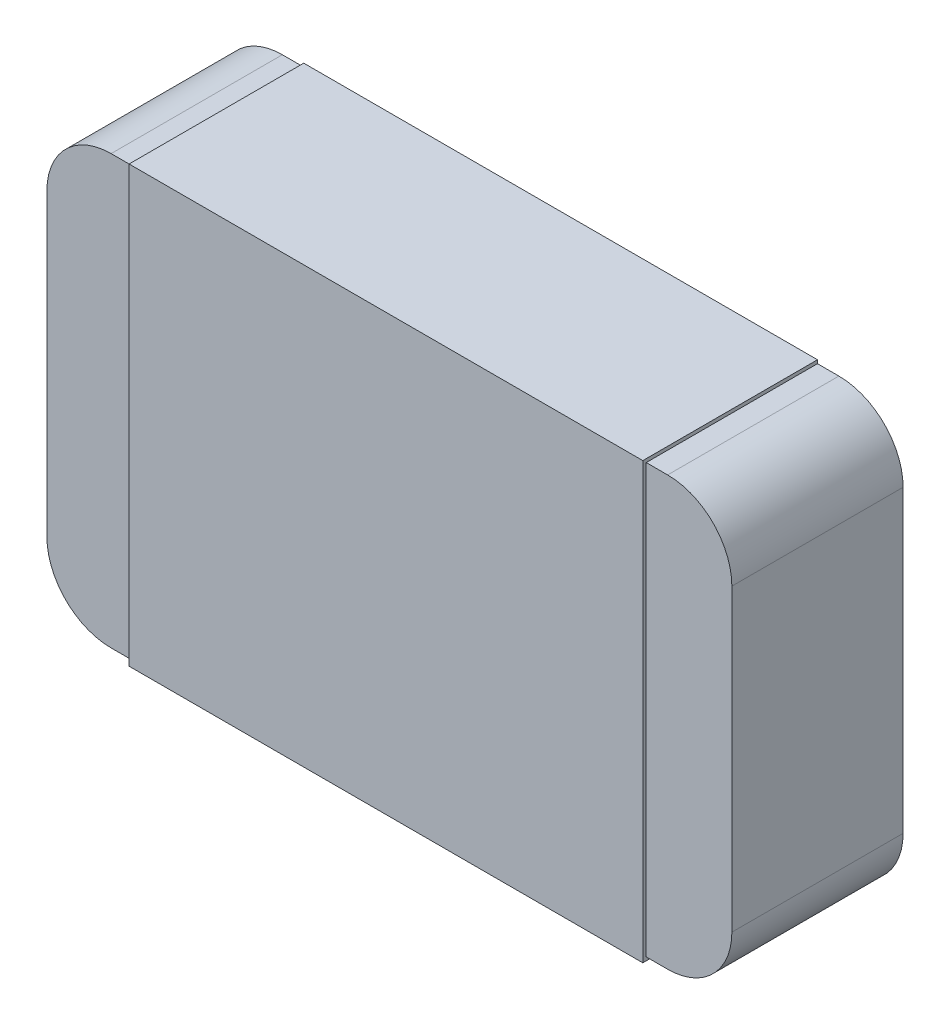
ISO-10303-21;
HEADER;
FILE_DESCRIPTION(('STEP AP214'),'2;1');
FILE_NAME('part.step','',(''),(''),'','','');
FILE_SCHEMA(('AUTOMOTIVE_DESIGN { 1 0 10303 214 1 1 1 1 }'));
ENDSEC;
DATA;
#1=APPLICATION_CONTEXT('core data for automotive mechanical design processes');
#2=APPLICATION_PROTOCOL_DEFINITION('international standard','automotive_design',2000,#1);
#3=PRODUCT_CONTEXT('',#1,'mechanical');
#4=PRODUCT('Part','Part','',(#3));
#5=PRODUCT_RELATED_PRODUCT_CATEGORY('part','',(#4));
#6=PRODUCT_DEFINITION_FORMATION('','',#4);
#7=PRODUCT_DEFINITION_CONTEXT('part definition',#1,'design');
#8=PRODUCT_DEFINITION('design','',#6,#7);
#9=PRODUCT_DEFINITION_SHAPE('','',#8);
#10=(LENGTH_UNIT() NAMED_UNIT(*) SI_UNIT(.MILLI.,.METRE.));
#11=(NAMED_UNIT(*) PLANE_ANGLE_UNIT() SI_UNIT($,.RADIAN.));
#12=(NAMED_UNIT(*) SI_UNIT($,.STERADIAN.) SOLID_ANGLE_UNIT());
#13=UNCERTAINTY_MEASURE_WITH_UNIT(LENGTH_MEASURE(1.E-05),#10,'distance_accuracy_value','');
#14=(GEOMETRIC_REPRESENTATION_CONTEXT(3) GLOBAL_UNCERTAINTY_ASSIGNED_CONTEXT((#13)) GLOBAL_UNIT_ASSIGNED_CONTEXT((#10,
#11,#12)) REPRESENTATION_CONTEXT('',''));
#15=CARTESIAN_POINT('',(0.,0.,0.));
#16=DIRECTION('',(0.,0.,1.));
#17=DIRECTION('',(1.,0.,0.));
#18=AXIS2_PLACEMENT_3D('',#15,#16,#17);
#19=CARTESIAN_POINT('',(-0.999940970499156,0.625046181345618,0.500000027319617));
#20=DIRECTION('',(1.74845553146949E-07,-0.999999999999984,-4.37113882867386E-08));
#21=DIRECTION('',(0.999999999999985,1.74845553146949E-07,0.));
#22=AXIS2_PLACEMENT_3D('',#19,#20,#21);
#23=PLANE('',#22);
#24=DIRECTION('',(-0.999999999999985,-1.74845553146949E-07,0.));
#25=VECTOR('',#24,1.);
#26=CARTESIAN_POINT('',(-0.99994097049916,0.625046203201312,2.73196176792116E-08));
#27=LINE('',#26,#25);
#28=CARTESIAN_POINT('',(-0.749940970499164,0.6250462469127,2.73196176792116E-08));
#29=VERTEX_POINT('',#28);
#30=CARTESIAN_POINT('',(-0.812440970499163,0.625046235984853,2.73196176792116E-08));
#31=VERTEX_POINT('',#30);
#32=EDGE_CURVE('E10',#29,#31,#27,.T.);
#33=ORIENTED_EDGE('',*,*,#32,.T.);
#34=DIRECTION('',(0.,-4.37113882867379E-08,0.999999999999999));
#35=VECTOR('',#34,1.);
#36=CARTESIAN_POINT('',(-0.812440970499159,0.625046214129159,0.500000027319617));
#37=LINE('',#36,#35);
#38=CARTESIAN_POINT('',(-0.812440970499159,0.625046214129159,0.500000027319617));
#39=VERTEX_POINT('',#38);
#40=EDGE_CURVE('E22',#31,#39,#37,.T.);
#41=ORIENTED_EDGE('',*,*,#40,.T.);
#42=DIRECTION('',(-0.999999999999985,-1.74845553146949E-07,0.));
#43=VECTOR('',#42,1.);
#44=CARTESIAN_POINT('',(-0.999940970499156,0.625046181345618,0.500000027319617));
#45=LINE('',#44,#43);
#46=CARTESIAN_POINT('',(-0.74994097049916,0.625046225057006,0.500000027319617));
#47=VERTEX_POINT('',#46);
#48=EDGE_CURVE('E252',#47,#39,#45,.T.);
#49=ORIENTED_EDGE('',*,*,#48,.F.);
#50=DIRECTION('',(0.,4.37113882867379E-08,-0.999999999999999));
#51=VECTOR('',#50,1.);
#52=CARTESIAN_POINT('',(-0.74994097049916,0.625046225057006,0.500000027319617));
#53=LINE('',#52,#51);
#54=EDGE_CURVE('E250',#47,#29,#53,.T.);
#55=ORIENTED_EDGE('',*,*,#54,.T.);
#56=EDGE_LOOP('',(#33,#41,#49,#55));
#57=FACE_BOUND('',#56,.T.);
#58=ADVANCED_FACE('F15',(#57),#23,.F.);
#59=CARTESIAN_POINT('',(-0.999940751942214,-0.624953818654362,0.499999972680382));
#60=DIRECTION('',(-1.74845553146949E-07,0.999999999999984,4.37113882867386E-08));
#61=DIRECTION('',(-0.999999999999985,-1.74845553146949E-07,0.));
#62=AXIS2_PLACEMENT_3D('',#59,#60,#61);
#63=PLANE('',#62);
#64=DIRECTION('',(0.999999999999985,1.74845553146949E-07,0.));
#65=VECTOR('',#64,1.);
#66=CARTESIAN_POINT('',(-0.999940751942214,-0.624953818654362,0.499999972680382));
#67=LINE('',#66,#65);
#68=CARTESIAN_POINT('',(-0.812440751942217,-0.624953785870821,0.499999972680382));
#69=VERTEX_POINT('',#68);
#70=CARTESIAN_POINT('',(-0.749940751942218,-0.624953774942974,0.499999972680382));
#71=VERTEX_POINT('',#70);
#72=EDGE_CURVE('E247',#69,#71,#67,.T.);
#73=ORIENTED_EDGE('',*,*,#72,.F.);
#74=DIRECTION('',(0.,4.37113882867379E-08,-0.999999999999999));
#75=VECTOR('',#74,1.);
#76=CARTESIAN_POINT('',(-0.812440751942217,-0.624953785870821,0.499999972680382));
#77=LINE('',#76,#75);
#78=CARTESIAN_POINT('',(-0.812440751942221,-0.624953764015127,-2.73196176792116E-08));
#79=VERTEX_POINT('',#78);
#80=EDGE_CURVE('E244',#69,#79,#77,.T.);
#81=ORIENTED_EDGE('',*,*,#80,.T.);
#82=DIRECTION('',(0.999999999999985,1.74845553146949E-07,0.));
#83=VECTOR('',#82,1.);
#84=CARTESIAN_POINT('',(-0.999940751942218,-0.624953796798668,-2.73196176792116E-08));
#85=LINE('',#84,#83);
#86=CARTESIAN_POINT('',(-0.749940751942222,-0.62495375308728,-2.73196176792116E-08));
#87=VERTEX_POINT('',#86);
#88=EDGE_CURVE('E242',#79,#87,#85,.T.);
#89=ORIENTED_EDGE('',*,*,#88,.T.);
#90=DIRECTION('',(0.,-4.37113882867379E-08,0.999999999999999));
#91=VECTOR('',#90,1.);
#92=CARTESIAN_POINT('',(-0.749940751942218,-0.624953774942974,0.499999972680382));
#93=LINE('',#92,#91);
#94=EDGE_CURVE('E240',#87,#71,#93,.T.);
#95=ORIENTED_EDGE('',*,*,#94,.T.);
#96=EDGE_LOOP('',(#73,#81,#89,#95));
#97=FACE_BOUND('',#96,.T.);
#98=ADVANCED_FACE('F308',(#97),#63,.F.);
#99=CARTESIAN_POINT('',(5.91387792996856E-05,4.63561911807631E-05,0.5));
#100=DIRECTION('',(0.,-4.37113882867379E-08,0.999999999999999));
#101=DIRECTION('',(1.74845553146949E-07,-0.999999999999984,-4.37113882867386E-08));
#102=AXIS2_PLACEMENT_3D('',#99,#100,#101);
#103=PLANE('',#102);
#104=ORIENTED_EDGE('',*,*,#48,.T.);
#105=CARTESIAN_POINT('',(-0.812440937715618,0.437546214129162,0.500000019123732));
#106=DIRECTION('',(0.,-4.37113882867379E-08,0.999999999999999));
#107=DIRECTION('',(1.74845553146949E-07,-0.999999999999984,-4.37113882867386E-08));
#108=AXIS2_PLACEMENT_3D('',#105,#106,#107);
#109=CIRCLE('',#108,0.1875);
#110=CARTESIAN_POINT('',(-0.999940937715615,0.437546181345621,0.500000019123732));
#111=VERTEX_POINT('',#110);
#112=EDGE_CURVE('E237',#39,#111,#109,.T.);
#113=ORIENTED_EDGE('',*,*,#112,.T.);
#114=DIRECTION('',(1.74845553320421E-07,-0.999999999999984,-4.37113882867386E-08));
#115=VECTOR('',#114,1.);
#116=CARTESIAN_POINT('',(-0.999940970499156,0.625046181345618,0.500000027319617));
#117=LINE('',#116,#115);
#118=CARTESIAN_POINT('',(-0.999940784725755,-0.437453818654365,0.499999980876267));
#119=VERTEX_POINT('',#118);
#120=EDGE_CURVE('E235',#111,#119,#117,.T.);
#121=ORIENTED_EDGE('',*,*,#120,.T.);
#122=CARTESIAN_POINT('',(-0.812440784725759,-0.437453785870824,0.499999980876267));
#123=DIRECTION('',(0.,-4.37113882867379E-08,0.999999999999999));
#124=DIRECTION('',(1.74845553146949E-07,-0.999999999999984,-4.37113882867386E-08));
#125=AXIS2_PLACEMENT_3D('',#122,#123,#124);
#126=CIRCLE('',#125,0.1875);
#127=EDGE_CURVE('E233',#119,#69,#126,.T.);
#128=ORIENTED_EDGE('',*,*,#127,.T.);
#129=ORIENTED_EDGE('',*,*,#72,.T.);
#130=DIRECTION('',(1.74845553146949E-07,-0.999999999999984,-4.37113882867386E-08));
#131=VECTOR('',#130,1.);
#132=CARTESIAN_POINT('',(-0.74994097049916,0.625046225057006,0.500000027319617));
#133=LINE('',#132,#131);
#134=EDGE_CURVE('E230',#47,#71,#133,.T.);
#135=ORIENTED_EDGE('',*,*,#134,.F.);
#136=EDGE_LOOP('',(#104,#113,#121,#128,#129,#135));
#137=FACE_BOUND('',#136,.T.);
#138=ADVANCED_FACE('F262',(#137),#103,.T.);
#139=CARTESIAN_POINT('',(1.00005902950081,0.625046531036724,0.500000027319617));
#140=DIRECTION('',(-0.999999999999985,-1.74845553146949E-07,0.));
#141=DIRECTION('',(1.74845553146949E-07,-0.999999999999984,-4.37113882867386E-08));
#142=AXIS2_PLACEMENT_3D('',#139,#140,#141);
#143=PLANE('',#142);
#144=DIRECTION('',(-1.74845553146949E-07,0.999999999999984,4.37113882867386E-08));
#145=VECTOR('',#144,1.);
#146=CARTESIAN_POINT('',(1.00005902950081,0.625046552892418,2.73196176792116E-08));
#147=LINE('',#146,#145);
#148=CARTESIAN_POINT('',(1.00005921527421,-0.437453447107565,-1.91237323754481E-08));
#149=VERTEX_POINT('',#148);
#150=CARTESIAN_POINT('',(1.00005906228435,0.437546552892421,1.91237323754481E-08));
#151=VERTEX_POINT('',#150);
#152=EDGE_CURVE('E228',#149,#151,#147,.T.);
#153=ORIENTED_EDGE('',*,*,#152,.T.);
#154=DIRECTION('',(0.,-4.37113882867379E-08,0.999999999999999));
#155=VECTOR('',#154,1.);
#156=CARTESIAN_POINT('',(1.00005906228436,0.437546531036727,0.500000019123732));
#157=LINE('',#156,#155);
#158=CARTESIAN_POINT('',(1.00005906228436,0.437546531036727,0.500000019123732));
#159=VERTEX_POINT('',#158);
#160=EDGE_CURVE('E226',#151,#159,#157,.T.);
#161=ORIENTED_EDGE('',*,*,#160,.T.);
#162=DIRECTION('',(-1.74845553146949E-07,0.999999999999984,4.37113882867386E-08));
#163=VECTOR('',#162,1.);
#164=CARTESIAN_POINT('',(1.00005902950081,0.625046531036724,0.500000027319617));
#165=LINE('',#164,#163);
#166=CARTESIAN_POINT('',(1.00005921527421,-0.437453468963259,0.499999980876267));
#167=VERTEX_POINT('',#166);
#168=EDGE_CURVE('E223',#167,#159,#165,.T.);
#169=ORIENTED_EDGE('',*,*,#168,.F.);
#170=DIRECTION('',(0.,4.37113882867379E-08,-0.999999999999999));
#171=VECTOR('',#170,1.);
#172=CARTESIAN_POINT('',(1.00005921527421,-0.437453468963259,0.499999980876267));
#173=LINE('',#172,#171);
#174=EDGE_CURVE('E220',#167,#149,#173,.T.);
#175=ORIENTED_EDGE('',*,*,#174,.T.);
#176=EDGE_LOOP('',(#153,#161,#169,#175));
#177=FACE_BOUND('',#176,.T.);
#178=ADVANCED_FACE('F291',(#177),#143,.F.);
#179=CARTESIAN_POINT('',(-0.999940970499156,0.625046181345618,0.500000027319617));
#180=DIRECTION('',(1.74845553146949E-07,-0.999999999999984,-4.37113882867386E-08));
#181=DIRECTION('',(0.999999999999985,1.74845553146949E-07,0.));
#182=AXIS2_PLACEMENT_3D('',#179,#180,#181);
#183=PLANE('',#182);
#184=DIRECTION('',(-0.999999999999985,-1.74845553146949E-07,0.));
#185=VECTOR('',#184,1.);
#186=CARTESIAN_POINT('',(-0.999940970499156,0.625046181345618,0.500000027319617));
#187=LINE('',#186,#185);
#188=CARTESIAN_POINT('',(0.812559029500817,0.625046498253183,0.500000027319617));
#189=VERTEX_POINT('',#188);
#190=CARTESIAN_POINT('',(0.750059029500818,0.625046487325336,0.500000027319617));
#191=VERTEX_POINT('',#190);
#192=EDGE_CURVE('E217',#189,#191,#187,.T.);
#193=ORIENTED_EDGE('',*,*,#192,.F.);
#194=DIRECTION('',(0.,4.37113882867379E-08,-0.999999999999999));
#195=VECTOR('',#194,1.);
#196=CARTESIAN_POINT('',(0.812559029500817,0.625046498253183,0.500000027319617));
#197=LINE('',#196,#195);
#198=CARTESIAN_POINT('',(0.812559029500813,0.625046520108877,2.73196176792116E-08));
#199=VERTEX_POINT('',#198);
#200=EDGE_CURVE('E214',#189,#199,#197,.T.);
#201=ORIENTED_EDGE('',*,*,#200,.T.);
#202=DIRECTION('',(-0.999999999999985,-1.74845553146949E-07,0.));
#203=VECTOR('',#202,1.);
#204=CARTESIAN_POINT('',(-0.99994097049916,0.625046203201312,2.73196176792116E-08));
#205=LINE('',#204,#203);
#206=CARTESIAN_POINT('',(0.750059029500814,0.62504650918103,2.73196176792116E-08));
#207=VERTEX_POINT('',#206);
#208=EDGE_CURVE('E212',#199,#207,#205,.T.);
#209=ORIENTED_EDGE('',*,*,#208,.T.);
#210=DIRECTION('',(0.,-4.37113882867379E-08,0.999999999999999));
#211=VECTOR('',#210,1.);
#212=CARTESIAN_POINT('',(0.750059029500818,0.625046487325336,0.500000027319617));
#213=LINE('',#212,#211);
#214=EDGE_CURVE('E210',#207,#191,#213,.T.);
#215=ORIENTED_EDGE('',*,*,#214,.T.);
#216=EDGE_LOOP('',(#193,#201,#209,#215));
#217=FACE_BOUND('',#216,.T.);
#218=ADVANCED_FACE('F285',(#217),#183,.F.);
#219=CARTESIAN_POINT('',(-0.999940970499156,0.625046181345618,0.500000027319617));
#220=DIRECTION('',(0.999999999999985,1.74845553320421E-07,0.));
#221=DIRECTION('',(-1.74845553320421E-07,0.999999999999984,4.37113882867386E-08));
#222=AXIS2_PLACEMENT_3D('',#219,#220,#221);
#223=PLANE('',#222);
#224=ORIENTED_EDGE('',*,*,#120,.F.);
#225=DIRECTION('',(0.,4.37113882867379E-08,-0.999999999999999));
#226=VECTOR('',#225,1.);
#227=CARTESIAN_POINT('',(-0.999940937715615,0.437546181345621,0.500000019123732));
#228=LINE('',#227,#226);
#229=CARTESIAN_POINT('',(-0.999940937715618,0.437546203201315,1.91237323754481E-08));
#230=VERTEX_POINT('',#229);
#231=EDGE_CURVE('E207',#111,#230,#228,.T.);
#232=ORIENTED_EDGE('',*,*,#231,.T.);
#233=DIRECTION('',(1.74845553320421E-07,-0.999999999999984,-4.37113882867386E-08));
#234=VECTOR('',#233,1.);
#235=CARTESIAN_POINT('',(-0.99994097049916,0.625046203201312,2.73196176792116E-08));
#236=LINE('',#235,#234);
#237=CARTESIAN_POINT('',(-0.999940784725759,-0.437453796798671,-1.91237323754481E-08));
#238=VERTEX_POINT('',#237);
#239=EDGE_CURVE('E205',#230,#238,#236,.T.);
#240=ORIENTED_EDGE('',*,*,#239,.T.);
#241=DIRECTION('',(0.,-4.37113882867379E-08,0.999999999999999));
#242=VECTOR('',#241,1.);
#243=CARTESIAN_POINT('',(-0.999940784725755,-0.437453818654365,0.499999980876267));
#244=LINE('',#243,#242);
#245=EDGE_CURVE('E202',#238,#119,#244,.T.);
#246=ORIENTED_EDGE('',*,*,#245,.T.);
#247=EDGE_LOOP('',(#224,#232,#240,#246));
#248=FACE_BOUND('',#247,.T.);
#249=ADVANCED_FACE('F297',(#248),#223,.F.);
#250=CARTESIAN_POINT('',(-0.999940751942214,-0.624953818654362,0.499999972680382));
#251=DIRECTION('',(-1.74845553146949E-07,0.999999999999984,4.37113882867386E-08));
#252=DIRECTION('',(-0.999999999999985,-1.74845553146949E-07,0.));
#253=AXIS2_PLACEMENT_3D('',#250,#251,#252);
#254=PLANE('',#253);
#255=DIRECTION('',(0.999999999999985,1.74845553146949E-07,0.));
#256=VECTOR('',#255,1.);
#257=CARTESIAN_POINT('',(-0.999940751942218,-0.624953796798668,-2.73196176792116E-08));
#258=LINE('',#257,#256);
#259=CARTESIAN_POINT('',(0.750059248057755,-0.62495349081895,-2.73196176792116E-08));
#260=VERTEX_POINT('',#259);
#261=CARTESIAN_POINT('',(0.812559248057754,-0.624953479891103,-2.73196176792116E-08));
#262=VERTEX_POINT('',#261);
#263=EDGE_CURVE('E199',#260,#262,#258,.T.);
#264=ORIENTED_EDGE('',*,*,#263,.T.);
#265=DIRECTION('',(0.,-4.37113882867379E-08,0.999999999999999));
#266=VECTOR('',#265,1.);
#267=CARTESIAN_POINT('',(0.812559248057758,-0.624953501746797,0.499999972680382));
#268=LINE('',#267,#266);
#269=CARTESIAN_POINT('',(0.812559248057758,-0.624953501746797,0.499999972680382));
#270=VERTEX_POINT('',#269);
#271=EDGE_CURVE('E197',#262,#270,#268,.T.);
#272=ORIENTED_EDGE('',*,*,#271,.T.);
#273=DIRECTION('',(0.999999999999985,1.74845553146949E-07,0.));
#274=VECTOR('',#273,1.);
#275=CARTESIAN_POINT('',(-0.999940751942214,-0.624953818654362,0.499999972680382));
#276=LINE('',#275,#274);
#277=CARTESIAN_POINT('',(0.750059248057759,-0.624953512674644,0.499999972680382));
#278=VERTEX_POINT('',#277);
#279=EDGE_CURVE('E194',#278,#270,#276,.T.);
#280=ORIENTED_EDGE('',*,*,#279,.F.);
#281=DIRECTION('',(0.,4.37113882867379E-08,-0.999999999999999));
#282=VECTOR('',#281,1.);
#283=CARTESIAN_POINT('',(0.750059248057759,-0.624953512674644,0.499999972680382));
#284=LINE('',#283,#282);
#285=EDGE_CURVE('E192',#278,#260,#284,.T.);
#286=ORIENTED_EDGE('',*,*,#285,.T.);
#287=EDGE_LOOP('',(#264,#272,#280,#286));
#288=FACE_BOUND('',#287,.T.);
#289=ADVANCED_FACE('F295',(#288),#254,.F.);
#290=CARTESIAN_POINT('',(5.91387792996856E-05,4.63561911807631E-05,0.5));
#291=DIRECTION('',(0.,-4.37113882867379E-08,0.999999999999999));
#292=DIRECTION('',(1.74845553146949E-07,-0.999999999999984,-4.37113882867386E-08));
#293=AXIS2_PLACEMENT_3D('',#290,#291,#292);
#294=PLANE('',#293);
#295=ORIENTED_EDGE('',*,*,#168,.T.);
#296=CARTESIAN_POINT('',(0.812559062284358,0.437546498253186,0.500000019123732));
#297=DIRECTION('',(0.,-4.37113882867379E-08,0.999999999999999));
#298=DIRECTION('',(1.74845553146949E-07,-0.999999999999984,-4.37113882867386E-08));
#299=AXIS2_PLACEMENT_3D('',#296,#297,#298);
#300=CIRCLE('',#299,0.1875);
#301=EDGE_CURVE('E189',#159,#189,#300,.T.);
#302=ORIENTED_EDGE('',*,*,#301,.T.);
#303=ORIENTED_EDGE('',*,*,#192,.T.);
#304=DIRECTION('',(-1.74845553146949E-07,0.999999999999984,4.37113882867386E-08));
#305=VECTOR('',#304,1.);
#306=CARTESIAN_POINT('',(0.750059029500818,0.625046487325336,0.500000027319617));
#307=LINE('',#306,#305);
#308=EDGE_CURVE('E187',#278,#191,#307,.T.);
#309=ORIENTED_EDGE('',*,*,#308,.F.);
#310=ORIENTED_EDGE('',*,*,#279,.T.);
#311=CARTESIAN_POINT('',(0.812559215274217,-0.4374535017468,0.499999980876267));
#312=DIRECTION('',(0.,-4.37113882867379E-08,0.999999999999999));
#313=DIRECTION('',(1.74845553146949E-07,-0.999999999999984,-4.37113882867386E-08));
#314=AXIS2_PLACEMENT_3D('',#311,#312,#313);
#315=CIRCLE('',#314,0.1875);
#316=EDGE_CURVE('E184',#270,#167,#315,.T.);
#317=ORIENTED_EDGE('',*,*,#316,.T.);
#318=EDGE_LOOP('',(#295,#302,#303,#309,#310,#317));
#319=FACE_BOUND('',#318,.T.);
#320=ADVANCED_FACE('F280',(#319),#294,.T.);
#321=CARTESIAN_POINT('',(5.91387792958642E-05,4.63780468749064E-05,0.));
#322=DIRECTION('',(0.,-4.37113882867379E-08,0.999999999999999));
#323=DIRECTION('',(1.74845553146949E-07,-0.999999999999984,-4.37113882867386E-08));
#324=AXIS2_PLACEMENT_3D('',#321,#322,#323);
#325=PLANE('',#324);
#326=ORIENTED_EDGE('',*,*,#208,.F.);
#327=CARTESIAN_POINT('',(0.812559062284354,0.43754652010888,1.91237323754481E-08));
#328=DIRECTION('',(0.,4.37113882867379E-08,-0.999999999999999));
#329=DIRECTION('',(1.74845553146949E-07,-0.999999999999984,-4.37113882867386E-08));
#330=AXIS2_PLACEMENT_3D('',#327,#328,#329);
#331=CIRCLE('',#330,0.1875);
#332=EDGE_CURVE('E181',#199,#151,#331,.T.);
#333=ORIENTED_EDGE('',*,*,#332,.T.);
#334=ORIENTED_EDGE('',*,*,#152,.F.);
#335=CARTESIAN_POINT('',(0.812559215274213,-0.437453479891106,-1.91237323754481E-08));
#336=DIRECTION('',(0.,4.37113882867379E-08,-0.999999999999999));
#337=DIRECTION('',(1.74845553146949E-07,-0.999999999999984,-4.37113882867386E-08));
#338=AXIS2_PLACEMENT_3D('',#335,#336,#337);
#339=CIRCLE('',#338,0.1875);
#340=EDGE_CURVE('E178',#149,#262,#339,.T.);
#341=ORIENTED_EDGE('',*,*,#340,.T.);
#342=ORIENTED_EDGE('',*,*,#263,.F.);
#343=DIRECTION('',(1.74845553146949E-07,-0.999999999999984,-4.37113882867386E-08));
#344=VECTOR('',#343,1.);
#345=CARTESIAN_POINT('',(0.750059027752358,0.635046509181029,2.7756731562079E-08));
#346=LINE('',#345,#344);
#347=CARTESIAN_POINT('',(0.750059249806211,-0.63495349081895,-2.7756731562079E-08));
#348=VERTEX_POINT('',#347);
#349=EDGE_CURVE('E176',#260,#348,#346,.T.);
#350=ORIENTED_EDGE('',*,*,#349,.T.);
#351=DIRECTION('',(0.999999999999985,1.74845553146949E-07,0.));
#352=VECTOR('',#351,1.);
#353=CARTESIAN_POINT('',(-0.749940750193766,-0.63495375308728,-2.7756731562079E-08));
#354=LINE('',#353,#352);
#355=CARTESIAN_POINT('',(-0.749940750193766,-0.63495375308728,-2.7756731562079E-08));
#356=VERTEX_POINT('',#355);
#357=EDGE_CURVE('E143',#356,#348,#354,.T.);
#358=ORIENTED_EDGE('',*,*,#357,.F.);
#359=DIRECTION('',(1.74845553146949E-07,-0.999999999999984,-4.37113882867386E-08));
#360=VECTOR('',#359,1.);
#361=CARTESIAN_POINT('',(-0.749940972247619,0.6350462469127,2.7756731562079E-08));
#362=LINE('',#361,#360);
#363=EDGE_CURVE('E172',#87,#356,#362,.T.);
#364=ORIENTED_EDGE('',*,*,#363,.F.);
#365=ORIENTED_EDGE('',*,*,#88,.F.);
#366=CARTESIAN_POINT('',(-0.812440784725762,-0.43745376401513,-1.91237323754481E-08));
#367=DIRECTION('',(0.,4.37113882867379E-08,-0.999999999999999));
#368=DIRECTION('',(1.74845553146949E-07,-0.999999999999984,-4.37113882867386E-08));
#369=AXIS2_PLACEMENT_3D('',#366,#367,#368);
#370=CIRCLE('',#369,0.1875);
#371=EDGE_CURVE('E169',#79,#238,#370,.T.);
#372=ORIENTED_EDGE('',*,*,#371,.T.);
#373=ORIENTED_EDGE('',*,*,#239,.F.);
#374=CARTESIAN_POINT('',(-0.812440937715622,0.437546235984856,1.91237323754481E-08));
#375=DIRECTION('',(0.,4.37113882867379E-08,-0.999999999999999));
#376=DIRECTION('',(1.74845554303431E-07,-0.999999999999984,-4.37113882867386E-08));
#377=AXIS2_PLACEMENT_3D('',#374,#375,#376);
#378=CIRCLE('',#377,0.1875);
#379=EDGE_CURVE('E167',#230,#31,#378,.T.);
#380=ORIENTED_EDGE('',*,*,#379,.T.);
#381=ORIENTED_EDGE('',*,*,#32,.F.);
#382=DIRECTION('',(1.74845553146949E-07,-0.999999999999984,-4.37113882867386E-08));
#383=VECTOR('',#382,1.);
#384=CARTESIAN_POINT('',(-0.749940972247619,0.6350462469127,2.7756731562079E-08));
#385=LINE('',#384,#383);
#386=CARTESIAN_POINT('',(-0.749940972247619,0.6350462469127,2.7756731562079E-08));
#387=VERTEX_POINT('',#386);
#388=EDGE_CURVE('E165',#387,#29,#385,.T.);
#389=ORIENTED_EDGE('',*,*,#388,.F.);
#390=DIRECTION('',(0.999999999999985,1.74845553146949E-07,0.));
#391=VECTOR('',#390,1.);
#392=CARTESIAN_POINT('',(-0.749940972247619,0.6350462469127,2.7756731562079E-08));
#393=LINE('',#392,#391);
#394=CARTESIAN_POINT('',(0.750059027752358,0.635046509181029,2.7756731562079E-08));
#395=VERTEX_POINT('',#394);
#396=EDGE_CURVE('E162',#387,#395,#393,.T.);
#397=ORIENTED_EDGE('',*,*,#396,.T.);
#398=DIRECTION('',(1.74845553146949E-07,-0.999999999999984,-4.37113882867386E-08));
#399=VECTOR('',#398,1.);
#400=CARTESIAN_POINT('',(0.750059027752358,0.635046509181029,2.7756731562079E-08));
#401=LINE('',#400,#399);
#402=EDGE_CURVE('E159',#395,#207,#401,.T.);
#403=ORIENTED_EDGE('',*,*,#402,.T.);
#404=EDGE_LOOP('',(#326,#333,#334,#341,#342,#350,#358,#364,#365,#372,#373,#380,#381,#389,#397,#403));
#405=FACE_BOUND('',#404,.T.);
#406=ADVANCED_FACE('F270',(#405),#325,.F.);
#407=CARTESIAN_POINT('',(-0.74994097049916,0.625046224619892,0.510000027319617));
#408=DIRECTION('',(0.999999999999985,1.74845553146949E-07,0.));
#409=DIRECTION('',(-1.74845553146949E-07,0.999999999999984,4.37113882867386E-08));
#410=AXIS2_PLACEMENT_3D('',#407,#408,#409);
#411=PLANE('',#410);
#412=ORIENTED_EDGE('',*,*,#134,.T.);
#413=ORIENTED_EDGE('',*,*,#94,.F.);
#414=ORIENTED_EDGE('',*,*,#363,.T.);
#415=DIRECTION('',(0.,4.37113882867379E-08,-0.999999999999999));
#416=VECTOR('',#415,1.);
#417=CARTESIAN_POINT('',(-0.749940750193763,-0.634953775380088,0.509999972243268));
#418=LINE('',#417,#416);
#419=CARTESIAN_POINT('',(-0.749940750193763,-0.634953775380088,0.509999972243268));
#420=VERTEX_POINT('',#419);
#421=EDGE_CURVE('E157',#420,#356,#418,.T.);
#422=ORIENTED_EDGE('',*,*,#421,.F.);
#423=DIRECTION('',(1.74845553146949E-07,-0.999999999999984,-4.37113882867386E-08));
#424=VECTOR('',#423,1.);
#425=CARTESIAN_POINT('',(-0.74994097049916,0.625046224619892,0.510000027319617));
#426=LINE('',#425,#424);
#427=CARTESIAN_POINT('',(-0.749940972247615,0.635046224619892,0.510000027756731));
#428=VERTEX_POINT('',#427);
#429=EDGE_CURVE('E148',#428,#420,#426,.T.);
#430=ORIENTED_EDGE('',*,*,#429,.F.);
#431=DIRECTION('',(0.,4.37113882867379E-08,-0.999999999999999));
#432=VECTOR('',#431,1.);
#433=CARTESIAN_POINT('',(-0.749940972247615,0.635046224619892,0.510000027756731));
#434=LINE('',#433,#432);
#435=EDGE_CURVE('E154',#428,#387,#434,.T.);
#436=ORIENTED_EDGE('',*,*,#435,.T.);
#437=ORIENTED_EDGE('',*,*,#388,.T.);
#438=ORIENTED_EDGE('',*,*,#54,.F.);
#439=EDGE_LOOP('',(#412,#413,#414,#422,#430,#436,#437,#438));
#440=FACE_BOUND('',#439,.T.);
#441=ADVANCED_FACE('F266',(#440),#411,.F.);
#442=CARTESIAN_POINT('',(0.750059029500818,0.625046486888222,0.510000027319617));
#443=DIRECTION('',(-0.999999999999985,-1.74845553146949E-07,0.));
#444=DIRECTION('',(1.74845553146949E-07,-0.999999999999984,-4.37113882867386E-08));
#445=AXIS2_PLACEMENT_3D('',#442,#443,#444);
#446=PLANE('',#445);
#447=ORIENTED_EDGE('',*,*,#308,.T.);
#448=ORIENTED_EDGE('',*,*,#214,.F.);
#449=ORIENTED_EDGE('',*,*,#402,.F.);
#450=DIRECTION('',(0.,-4.37113882867379E-08,0.999999999999999));
#451=VECTOR('',#450,1.);
#452=CARTESIAN_POINT('',(0.750059027752362,0.635046486888222,0.510000027756731));
#453=LINE('',#452,#451);
#454=CARTESIAN_POINT('',(0.750059027752362,0.635046486888222,0.510000027756731));
#455=VERTEX_POINT('',#454);
#456=EDGE_CURVE('E131',#395,#455,#453,.T.);
#457=ORIENTED_EDGE('',*,*,#456,.T.);
#458=DIRECTION('',(-1.74845553146949E-07,0.999999999999984,4.37113882867386E-08));
#459=VECTOR('',#458,1.);
#460=CARTESIAN_POINT('',(0.750059029500818,0.625046486888222,0.510000027319617));
#461=LINE('',#460,#459);
#462=CARTESIAN_POINT('',(0.750059249806215,-0.634953513111758,0.509999972243268));
#463=VERTEX_POINT('',#462);
#464=EDGE_CURVE('E123',#463,#455,#461,.T.);
#465=ORIENTED_EDGE('',*,*,#464,.F.);
#466=DIRECTION('',(0.,-4.37113882867379E-08,0.999999999999999));
#467=VECTOR('',#466,1.);
#468=CARTESIAN_POINT('',(0.750059249806215,-0.634953513111758,0.509999972243268));
#469=LINE('',#468,#467);
#470=EDGE_CURVE('E128',#348,#463,#469,.T.);
#471=ORIENTED_EDGE('',*,*,#470,.F.);
#472=ORIENTED_EDGE('',*,*,#349,.F.);
#473=ORIENTED_EDGE('',*,*,#285,.F.);
#474=EDGE_LOOP('',(#447,#448,#449,#457,#465,#471,#472,#473));
#475=FACE_BOUND('',#474,.T.);
#476=ADVANCED_FACE('F126',(#475),#446,.F.);
#477=CARTESIAN_POINT('',(5.9138779299762E-05,4.63557540668802E-05,0.51));
#478=DIRECTION('',(0.,-4.37113882867379E-08,0.999999999999999));
#479=DIRECTION('',(1.74845553146949E-07,-0.999999999999984,-4.37113882867386E-08));
#480=AXIS2_PLACEMENT_3D('',#477,#478,#479);
#481=PLANE('',#480);
#482=ORIENTED_EDGE('',*,*,#429,.T.);
#483=DIRECTION('',(-0.999999999999985,-1.74845553146949E-07,0.));
#484=VECTOR('',#483,1.);
#485=CARTESIAN_POINT('',(-0.749940750193763,-0.634953775380088,0.509999972243268));
#486=LINE('',#485,#484);
#487=EDGE_CURVE('E141',#463,#420,#486,.T.);
#488=ORIENTED_EDGE('',*,*,#487,.F.);
#489=ORIENTED_EDGE('',*,*,#464,.T.);
#490=DIRECTION('',(-0.999999999999985,-1.74845553146949E-07,0.));
#491=VECTOR('',#490,1.);
#492=CARTESIAN_POINT('',(-0.749940972247615,0.635046224619892,0.510000027756731));
#493=LINE('',#492,#491);
#494=EDGE_CURVE('E149',#455,#428,#493,.T.);
#495=ORIENTED_EDGE('',*,*,#494,.T.);
#496=EDGE_LOOP('',(#482,#488,#489,#495));
#497=FACE_BOUND('',#496,.T.);
#498=ADVANCED_FACE('F146',(#497),#481,.T.);
#499=CARTESIAN_POINT('',(5.92498062221125E-05,-0.634953621953115,-2.7756731562079E-08));
#500=DIRECTION('',(1.74845553146949E-07,-0.999999999999984,-4.37113882867386E-08));
#501=DIRECTION('',(0.999999999999985,1.74845553146949E-07,0.));
#502=AXIS2_PLACEMENT_3D('',#499,#500,#501);
#503=PLANE('',#502);
#504=ORIENTED_EDGE('',*,*,#421,.T.);
#505=ORIENTED_EDGE('',*,*,#357,.T.);
#506=ORIENTED_EDGE('',*,*,#470,.T.);
#507=ORIENTED_EDGE('',*,*,#487,.T.);
#508=EDGE_LOOP('',(#504,#505,#506,#507));
#509=FACE_BOUND('',#508,.T.);
#510=ADVANCED_FACE('F140',(#509),#503,.T.);
#511=CARTESIAN_POINT('',(5.90277523696159E-05,0.635046378046865,2.7756731562079E-08));
#512=DIRECTION('',(1.74845553146949E-07,-0.999999999999984,-4.37113882867386E-08));
#513=DIRECTION('',(0.999999999999985,1.74845553146949E-07,0.));
#514=AXIS2_PLACEMENT_3D('',#511,#512,#513);
#515=PLANE('',#514);
#516=ORIENTED_EDGE('',*,*,#435,.F.);
#517=ORIENTED_EDGE('',*,*,#494,.F.);
#518=ORIENTED_EDGE('',*,*,#456,.F.);
#519=ORIENTED_EDGE('',*,*,#396,.F.);
#520=EDGE_LOOP('',(#516,#517,#518,#519));
#521=FACE_BOUND('',#520,.T.);
#522=ADVANCED_FACE('F272',(#521),#515,.F.);
#523=CARTESIAN_POINT('',(0.812559062284358,0.437546498253186,0.500000019123732));
#524=DIRECTION('',(0.,4.37113882867379E-08,-0.999999999999999));
#525=DIRECTION('',(-1.74845553146949E-07,0.999999999999984,4.37113882867386E-08));
#526=AXIS2_PLACEMENT_3D('',#523,#524,#525);
#527=CYLINDRICAL_SURFACE('',#526,0.1875);
#528=ORIENTED_EDGE('',*,*,#301,.F.);
#529=ORIENTED_EDGE('',*,*,#160,.F.);
#530=ORIENTED_EDGE('',*,*,#332,.F.);
#531=ORIENTED_EDGE('',*,*,#200,.F.);
#532=EDGE_LOOP('',(#528,#529,#530,#531));
#533=FACE_BOUND('',#532,.T.);
#534=ADVANCED_FACE('F288',(#533),#527,.T.);
#535=CARTESIAN_POINT('',(0.812559215274217,-0.4374535017468,0.499999980876267));
#536=DIRECTION('',(0.,4.37113882867379E-08,-0.999999999999999));
#537=DIRECTION('',(-1.74845553146949E-07,0.999999999999984,4.37113882867386E-08));
#538=AXIS2_PLACEMENT_3D('',#535,#536,#537);
#539=CYLINDRICAL_SURFACE('',#538,0.1875);
#540=ORIENTED_EDGE('',*,*,#316,.F.);
#541=ORIENTED_EDGE('',*,*,#271,.F.);
#542=ORIENTED_EDGE('',*,*,#340,.F.);
#543=ORIENTED_EDGE('',*,*,#174,.F.);
#544=EDGE_LOOP('',(#540,#541,#542,#543));
#545=FACE_BOUND('',#544,.T.);
#546=ADVANCED_FACE('F293',(#545),#539,.T.);
#547=CARTESIAN_POINT('',(-0.812440937715618,0.437546214129162,0.500000019123732));
#548=DIRECTION('',(0.,4.37113882867379E-08,-0.999999999999999));
#549=DIRECTION('',(-1.74845553146949E-07,0.999999999999984,4.37113882867386E-08));
#550=AXIS2_PLACEMENT_3D('',#547,#548,#549);
#551=CYLINDRICAL_SURFACE('',#550,0.1875);
#552=ORIENTED_EDGE('',*,*,#112,.F.);
#553=ORIENTED_EDGE('',*,*,#40,.F.);
#554=ORIENTED_EDGE('',*,*,#379,.F.);
#555=ORIENTED_EDGE('',*,*,#231,.F.);
#556=EDGE_LOOP('',(#552,#553,#554,#555));
#557=FACE_BOUND('',#556,.T.);
#558=ADVANCED_FACE('F260',(#557),#551,.T.);
#559=CARTESIAN_POINT('',(-0.812440784725759,-0.437453785870824,0.499999980876267));
#560=DIRECTION('',(0.,4.37113882867379E-08,-0.999999999999999));
#561=DIRECTION('',(-1.74845553146949E-07,0.999999999999984,4.37113882867386E-08));
#562=AXIS2_PLACEMENT_3D('',#559,#560,#561);
#563=CYLINDRICAL_SURFACE('',#562,0.1875);
#564=ORIENTED_EDGE('',*,*,#127,.F.);
#565=ORIENTED_EDGE('',*,*,#245,.F.);
#566=ORIENTED_EDGE('',*,*,#371,.F.);
#567=ORIENTED_EDGE('',*,*,#80,.F.);
#568=EDGE_LOOP('',(#564,#565,#566,#567));
#569=FACE_BOUND('',#568,.T.);
#570=ADVANCED_FACE('F429',(#569),#563,.T.);
#571=CLOSED_SHELL('',(#58,#98,#138,#178,#218,#249,#289,#320,#406,#441,#476,#498,#510,#522,#534,
#546,#558,#570));
#572=MANIFOLD_SOLID_BREP('B1',#571);
#573=ADVANCED_BREP_SHAPE_REPRESENTATION('',(#18,#572),#14);
#574=SHAPE_DEFINITION_REPRESENTATION(#9,#573);
ENDSEC;
END-ISO-10303-21;
